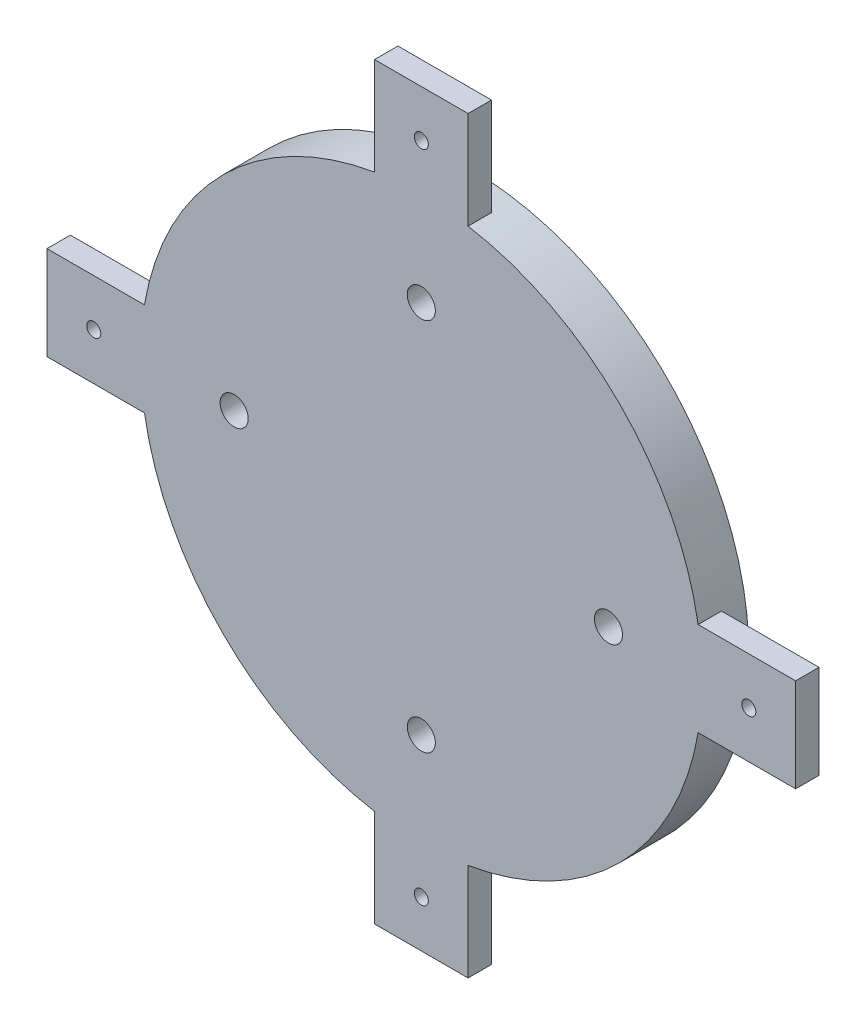
ISO-10303-21;
HEADER;
FILE_DESCRIPTION(('STEP AP214'),'2;1');
FILE_NAME('part.step','',(''),(''),'','','');
FILE_SCHEMA(('AUTOMOTIVE_DESIGN { 1 0 10303 214 1 1 1 1 }'));
ENDSEC;
DATA;
#1=APPLICATION_CONTEXT('core data for automotive mechanical design processes');
#2=APPLICATION_PROTOCOL_DEFINITION('international standard','automotive_design',2000,#1);
#3=PRODUCT_CONTEXT('',#1,'mechanical');
#4=PRODUCT('Part','Part','',(#3));
#5=PRODUCT_RELATED_PRODUCT_CATEGORY('part','',(#4));
#6=PRODUCT_DEFINITION_FORMATION('','',#4);
#7=PRODUCT_DEFINITION_CONTEXT('part definition',#1,'design');
#8=PRODUCT_DEFINITION('design','',#6,#7);
#9=PRODUCT_DEFINITION_SHAPE('','',#8);
#10=(LENGTH_UNIT() NAMED_UNIT(*) SI_UNIT(.MILLI.,.METRE.));
#11=(NAMED_UNIT(*) PLANE_ANGLE_UNIT() SI_UNIT($,.RADIAN.));
#12=(NAMED_UNIT(*) SI_UNIT($,.STERADIAN.) SOLID_ANGLE_UNIT());
#13=UNCERTAINTY_MEASURE_WITH_UNIT(LENGTH_MEASURE(1.E-05),#10,'distance_accuracy_value','');
#14=(GEOMETRIC_REPRESENTATION_CONTEXT(3) GLOBAL_UNCERTAINTY_ASSIGNED_CONTEXT((#13)) GLOBAL_UNIT_ASSIGNED_CONTEXT((#10,
#11,#12)) REPRESENTATION_CONTEXT('',''));
#15=CARTESIAN_POINT('',(0.,0.,0.));
#16=DIRECTION('',(0.,0.,1.));
#17=DIRECTION('',(1.,0.,0.));
#18=AXIS2_PLACEMENT_3D('',#15,#16,#17);
#19=CARTESIAN_POINT('',(0.,0.,5.));
#20=DIRECTION('',(0.,0.,-1.));
#21=DIRECTION('',(-1.,0.,0.));
#22=AXIS2_PLACEMENT_3D('',#19,#20,#21);
#23=CYLINDRICAL_SURFACE('',#22,60.);
#24=CARTESIAN_POINT('',(0.,0.,-10.));
#25=DIRECTION('',(0.,0.,-1.));
#26=DIRECTION('',(-1.,0.,0.));
#27=AXIS2_PLACEMENT_3D('',#24,#25,#26);
#28=CIRCLE('',#27,60.);
#29=CARTESIAN_POINT('',(-60.,0.,-10.));
#30=VERTEX_POINT('',#29);
#31=EDGE_CURVE('E169',#30,#30,#28,.T.);
#32=ORIENTED_EDGE('',*,*,#31,.F.);
#33=EDGE_LOOP('',(#32));
#34=FACE_BOUND('',#33,.T.);
#35=CARTESIAN_POINT('',(0.,0.,0.));
#36=DIRECTION('',(0.,0.,1.));
#37=DIRECTION('',(1.,0.,0.));
#38=AXIS2_PLACEMENT_3D('',#35,#36,#37);
#39=CIRCLE('',#38,60.);
#40=CARTESIAN_POINT('',(59.1607978309962,9.99999999999999,0.));
#41=VERTEX_POINT('',#40);
#42=CARTESIAN_POINT('',(9.99999999999947,59.1607978309962,0.));
#43=VERTEX_POINT('',#42);
#44=EDGE_CURVE('E11',#41,#43,#39,.T.);
#45=ORIENTED_EDGE('',*,*,#44,.F.);
#46=DIRECTION('',(0.,0.,1.));
#47=VECTOR('',#46,1.);
#48=CARTESIAN_POINT('',(59.1607978309962,9.99999999999999,-10.));
#49=LINE('',#48,#47);
#50=CARTESIAN_POINT('',(59.1607978309962,9.99999999999999,-5.));
#51=VERTEX_POINT('',#50);
#52=EDGE_CURVE('E191',#41,#51,#49,.F.);
#53=ORIENTED_EDGE('',*,*,#52,.T.);
#54=CARTESIAN_POINT('',(0.,0.,-5.));
#55=DIRECTION('',(0.,0.,1.));
#56=DIRECTION('',(1.,0.,0.));
#57=AXIS2_PLACEMENT_3D('',#54,#55,#56);
#58=CIRCLE('',#57,60.);
#59=CARTESIAN_POINT('',(59.1607978309962,-10.,-5.));
#60=VERTEX_POINT('',#59);
#61=EDGE_CURVE('E183',#51,#60,#58,.F.);
#62=ORIENTED_EDGE('',*,*,#61,.T.);
#63=DIRECTION('',(0.,0.,1.));
#64=VECTOR('',#63,1.);
#65=CARTESIAN_POINT('',(59.1607978309962,-10.,-10.));
#66=LINE('',#65,#64);
#67=CARTESIAN_POINT('',(59.1607978309962,-10.,0.));
#68=VERTEX_POINT('',#67);
#69=EDGE_CURVE('E187',#60,#68,#66,.T.);
#70=ORIENTED_EDGE('',*,*,#69,.T.);
#71=CARTESIAN_POINT('',(9.99999999999947,-59.1607978309962,0.));
#72=VERTEX_POINT('',#71);
#73=EDGE_CURVE('E50',#72,#68,#39,.T.);
#74=ORIENTED_EDGE('',*,*,#73,.F.);
#75=DIRECTION('',(0.,0.,1.));
#76=VECTOR('',#75,1.);
#77=CARTESIAN_POINT('',(9.99999999999947,-59.1607978309963,-10.));
#78=LINE('',#77,#76);
#79=CARTESIAN_POINT('',(9.99999999999947,-59.1607978309963,-5.));
#80=VERTEX_POINT('',#79);
#81=EDGE_CURVE('E211',#72,#80,#78,.F.);
#82=ORIENTED_EDGE('',*,*,#81,.T.);
#83=CARTESIAN_POINT('',(0.,0.,-5.));
#84=DIRECTION('',(0.,0.,1.));
#85=DIRECTION('',(1.,0.,0.));
#86=AXIS2_PLACEMENT_3D('',#83,#84,#85);
#87=CIRCLE('',#86,60.);
#88=CARTESIAN_POINT('',(-10.0000000000005,-59.1607978309961,-5.));
#89=VERTEX_POINT('',#88);
#90=EDGE_CURVE('E207',#80,#89,#87,.F.);
#91=ORIENTED_EDGE('',*,*,#90,.T.);
#92=DIRECTION('',(0.,0.,1.));
#93=VECTOR('',#92,1.);
#94=CARTESIAN_POINT('',(-10.0000000000005,-59.1607978309961,-10.));
#95=LINE('',#94,#93);
#96=CARTESIAN_POINT('',(-10.0000000000005,-59.1607978309961,0.));
#97=VERTEX_POINT('',#96);
#98=EDGE_CURVE('E215',#89,#97,#95,.T.);
#99=ORIENTED_EDGE('',*,*,#98,.T.);
#100=CARTESIAN_POINT('',(-59.1607978309962,-10.,0.));
#101=VERTEX_POINT('',#100);
#102=EDGE_CURVE('E105',#101,#97,#39,.T.);
#103=ORIENTED_EDGE('',*,*,#102,.F.);
#104=DIRECTION('',(0.,0.,1.));
#105=VECTOR('',#104,1.);
#106=CARTESIAN_POINT('',(-59.1607978309962,-10.,-10.));
#107=LINE('',#106,#105);
#108=CARTESIAN_POINT('',(-59.1607978309962,-10.,-5.));
#109=VERTEX_POINT('',#108);
#110=EDGE_CURVE('E199',#101,#109,#107,.F.);
#111=ORIENTED_EDGE('',*,*,#110,.T.);
#112=CARTESIAN_POINT('',(0.,0.,-5.));
#113=DIRECTION('',(0.,0.,-1.));
#114=DIRECTION('',(-1.,0.,0.));
#115=AXIS2_PLACEMENT_3D('',#112,#113,#114);
#116=CIRCLE('',#115,60.);
#117=CARTESIAN_POINT('',(-59.1607978309962,9.99999999999999,-5.));
#118=VERTEX_POINT('',#117);
#119=EDGE_CURVE('E195',#118,#109,#116,.F.);
#120=ORIENTED_EDGE('',*,*,#119,.F.);
#121=DIRECTION('',(0.,0.,1.));
#122=VECTOR('',#121,1.);
#123=CARTESIAN_POINT('',(-59.1607978309962,9.99999999999999,-10.));
#124=LINE('',#123,#122);
#125=CARTESIAN_POINT('',(-59.1607978309962,9.99999999999999,0.));
#126=VERTEX_POINT('',#125);
#127=EDGE_CURVE('E203',#118,#126,#124,.T.);
#128=ORIENTED_EDGE('',*,*,#127,.T.);
#129=CARTESIAN_POINT('',(-10.0000000000005,59.1607978309961,0.));
#130=VERTEX_POINT('',#129);
#131=EDGE_CURVE('E48',#130,#126,#39,.T.);
#132=ORIENTED_EDGE('',*,*,#131,.F.);
#133=DIRECTION('',(0.,0.,1.));
#134=VECTOR('',#133,1.);
#135=CARTESIAN_POINT('',(-10.0000000000005,59.1607978309961,-10.));
#136=LINE('',#135,#134);
#137=CARTESIAN_POINT('',(-10.0000000000005,59.1607978309961,-5.));
#138=VERTEX_POINT('',#137);
#139=EDGE_CURVE('E57',#130,#138,#136,.F.);
#140=ORIENTED_EDGE('',*,*,#139,.T.);
#141=CARTESIAN_POINT('',(0.,0.,-5.));
#142=DIRECTION('',(0.,0.,-1.));
#143=DIRECTION('',(-1.,0.,0.));
#144=AXIS2_PLACEMENT_3D('',#141,#142,#143);
#145=CIRCLE('',#144,60.);
#146=CARTESIAN_POINT('',(9.99999999999947,59.1607978309963,-5.));
#147=VERTEX_POINT('',#146);
#148=EDGE_CURVE('E173',#147,#138,#145,.F.);
#149=ORIENTED_EDGE('',*,*,#148,.F.);
#150=DIRECTION('',(0.,0.,1.));
#151=VECTOR('',#150,1.);
#152=CARTESIAN_POINT('',(9.99999999999947,59.1607978309963,-10.));
#153=LINE('',#152,#151);
#154=EDGE_CURVE('E177',#147,#43,#153,.T.);
#155=ORIENTED_EDGE('',*,*,#154,.T.);
#156=EDGE_LOOP('',(#45,#53,#62,#70,#74,#82,#91,#99,#103,#111,#120,#128,#132,#140,#149,#155));
#157=FACE_BOUND('',#156,.T.);
#158=ADVANCED_FACE('F39',(#34,#157),#23,.T.);
#159=CARTESIAN_POINT('',(-10.0000000000005,-49.9999999999999,-5.));
#160=DIRECTION('',(1.,0.,0.));
#161=DIRECTION('',(0.,0.,-1.));
#162=AXIS2_PLACEMENT_3D('',#159,#160,#161);
#163=PLANE('',#162);
#164=ORIENTED_EDGE('',*,*,#98,.F.);
#165=DIRECTION('',(0.,1.,0.));
#166=VECTOR('',#165,1.);
#167=CARTESIAN_POINT('',(-10.0000000000005,-49.9999999999999,-5.));
#168=LINE('',#167,#166);
#169=CARTESIAN_POINT('',(-10.0000000000005,-80.0000000000001,-5.));
#170=VERTEX_POINT('',#169);
#171=EDGE_CURVE('E90',#170,#89,#168,.T.);
#172=ORIENTED_EDGE('',*,*,#171,.F.);
#173=DIRECTION('',(0.,0.,1.));
#174=VECTOR('',#173,1.);
#175=CARTESIAN_POINT('',(-10.0000000000005,-80.0000000000001,-5.));
#176=LINE('',#175,#174);
#177=CARTESIAN_POINT('',(-10.0000000000005,-80.0000000000001,0.));
#178=VERTEX_POINT('',#177);
#179=EDGE_CURVE('E82',#170,#178,#176,.T.);
#180=ORIENTED_EDGE('',*,*,#179,.T.);
#181=DIRECTION('',(0.,1.,0.));
#182=VECTOR('',#181,1.);
#183=CARTESIAN_POINT('',(-10.0000000000005,-49.9999999999999,0.));
#184=LINE('',#183,#182);
#185=EDGE_CURVE('E98',#178,#97,#184,.T.);
#186=ORIENTED_EDGE('',*,*,#185,.T.);
#187=EDGE_LOOP('',(#164,#172,#180,#186));
#188=FACE_BOUND('',#187,.T.);
#189=ADVANCED_FACE('F96',(#188),#163,.F.);
#190=CARTESIAN_POINT('',(9.99999999999947,-50.0000000000001,-5.));
#191=DIRECTION('',(-1.,0.,0.));
#192=DIRECTION('',(0.,0.,1.));
#193=AXIS2_PLACEMENT_3D('',#190,#191,#192);
#194=PLANE('',#193);
#195=ORIENTED_EDGE('',*,*,#81,.F.);
#196=DIRECTION('',(0.,-1.,0.));
#197=VECTOR('',#196,1.);
#198=CARTESIAN_POINT('',(9.99999999999947,-50.0000000000001,0.));
#199=LINE('',#198,#197);
#200=CARTESIAN_POINT('',(9.99999999999947,-80.0000000000001,0.));
#201=VERTEX_POINT('',#200);
#202=EDGE_CURVE('E91',#72,#201,#199,.T.);
#203=ORIENTED_EDGE('',*,*,#202,.T.);
#204=DIRECTION('',(0.,0.,1.));
#205=VECTOR('',#204,1.);
#206=CARTESIAN_POINT('',(9.99999999999947,-80.0000000000001,-5.));
#207=LINE('',#206,#205);
#208=CARTESIAN_POINT('',(9.99999999999947,-80.0000000000001,-5.));
#209=VERTEX_POINT('',#208);
#210=EDGE_CURVE('E85',#209,#201,#207,.T.);
#211=ORIENTED_EDGE('',*,*,#210,.F.);
#212=DIRECTION('',(0.,-1.,0.));
#213=VECTOR('',#212,1.);
#214=CARTESIAN_POINT('',(9.99999999999947,-50.0000000000001,-5.));
#215=LINE('',#214,#213);
#216=EDGE_CURVE('E310',#80,#209,#215,.T.);
#217=ORIENTED_EDGE('',*,*,#216,.F.);
#218=EDGE_LOOP('',(#195,#203,#211,#217));
#219=FACE_BOUND('',#218,.T.);
#220=ADVANCED_FACE('F411',(#219),#194,.F.);
#221=CARTESIAN_POINT('',(-50.,9.99999999999999,-5.));
#222=DIRECTION('',(0.,-1.,0.));
#223=DIRECTION('',(0.,0.,-1.));
#224=AXIS2_PLACEMENT_3D('',#221,#222,#223);
#225=PLANE('',#224);
#226=ORIENTED_EDGE('',*,*,#127,.F.);
#227=DIRECTION('',(1.,0.,0.));
#228=VECTOR('',#227,1.);
#229=CARTESIAN_POINT('',(-50.,9.99999999999999,-5.));
#230=LINE('',#229,#228);
#231=CARTESIAN_POINT('',(-80.,9.99999999999999,-5.));
#232=VERTEX_POINT('',#231);
#233=EDGE_CURVE('E287',#232,#118,#230,.T.);
#234=ORIENTED_EDGE('',*,*,#233,.F.);
#235=DIRECTION('',(0.,0.,1.));
#236=VECTOR('',#235,1.);
#237=CARTESIAN_POINT('',(-80.,9.99999999999999,-5.));
#238=LINE('',#237,#236);
#239=CARTESIAN_POINT('',(-80.,9.99999999999999,0.));
#240=VERTEX_POINT('',#239);
#241=EDGE_CURVE('E108',#232,#240,#238,.T.);
#242=ORIENTED_EDGE('',*,*,#241,.T.);
#243=DIRECTION('',(1.,0.,0.));
#244=VECTOR('',#243,1.);
#245=CARTESIAN_POINT('',(-50.,9.99999999999999,0.));
#246=LINE('',#245,#244);
#247=EDGE_CURVE('E299',#240,#126,#246,.T.);
#248=ORIENTED_EDGE('',*,*,#247,.T.);
#249=EDGE_LOOP('',(#226,#234,#242,#248));
#250=FACE_BOUND('',#249,.T.);
#251=ADVANCED_FACE('F333',(#250),#225,.F.);
#252=CARTESIAN_POINT('',(-50.,-10.,-5.));
#253=DIRECTION('',(0.,1.,0.));
#254=DIRECTION('',(0.,0.,1.));
#255=AXIS2_PLACEMENT_3D('',#252,#253,#254);
#256=PLANE('',#255);
#257=ORIENTED_EDGE('',*,*,#110,.F.);
#258=DIRECTION('',(-1.,0.,0.));
#259=VECTOR('',#258,1.);
#260=CARTESIAN_POINT('',(-50.,-10.,0.));
#261=LINE('',#260,#259);
#262=CARTESIAN_POINT('',(-80.,-10.,0.));
#263=VERTEX_POINT('',#262);
#264=EDGE_CURVE('E288',#101,#263,#261,.T.);
#265=ORIENTED_EDGE('',*,*,#264,.T.);
#266=DIRECTION('',(0.,0.,1.));
#267=VECTOR('',#266,1.);
#268=CARTESIAN_POINT('',(-80.,-10.,-5.));
#269=LINE('',#268,#267);
#270=CARTESIAN_POINT('',(-80.,-10.,-5.));
#271=VERTEX_POINT('',#270);
#272=EDGE_CURVE('E114',#271,#263,#269,.T.);
#273=ORIENTED_EDGE('',*,*,#272,.F.);
#274=DIRECTION('',(-1.,0.,0.));
#275=VECTOR('',#274,1.);
#276=CARTESIAN_POINT('',(-50.,-10.,-5.));
#277=LINE('',#276,#275);
#278=EDGE_CURVE('E292',#109,#271,#277,.T.);
#279=ORIENTED_EDGE('',*,*,#278,.F.);
#280=EDGE_LOOP('',(#257,#265,#273,#279));
#281=FACE_BOUND('',#280,.T.);
#282=ADVANCED_FACE('F418',(#281),#256,.F.);
#283=CARTESIAN_POINT('',(50.,9.99999999999999,-5.));
#284=DIRECTION('',(0.,-1.,0.));
#285=DIRECTION('',(0.,0.,-1.));
#286=AXIS2_PLACEMENT_3D('',#283,#284,#285);
#287=PLANE('',#286);
#288=ORIENTED_EDGE('',*,*,#52,.F.);
#289=DIRECTION('',(1.,0.,0.));
#290=VECTOR('',#289,1.);
#291=CARTESIAN_POINT('',(50.,9.99999999999999,0.));
#292=LINE('',#291,#290);
#293=CARTESIAN_POINT('',(80.,9.99999999999999,0.));
#294=VERTEX_POINT('',#293);
#295=EDGE_CURVE('E250',#41,#294,#292,.T.);
#296=ORIENTED_EDGE('',*,*,#295,.T.);
#297=DIRECTION('',(0.,0.,1.));
#298=VECTOR('',#297,1.);
#299=CARTESIAN_POINT('',(80.,9.99999999999999,-5.));
#300=LINE('',#299,#298);
#301=CARTESIAN_POINT('',(80.,9.99999999999999,-5.));
#302=VERTEX_POINT('',#301);
#303=EDGE_CURVE('E278',#302,#294,#300,.T.);
#304=ORIENTED_EDGE('',*,*,#303,.F.);
#305=DIRECTION('',(1.,0.,0.));
#306=VECTOR('',#305,1.);
#307=CARTESIAN_POINT('',(50.,9.99999999999999,-5.));
#308=LINE('',#307,#306);
#309=EDGE_CURVE('E251',#51,#302,#308,.T.);
#310=ORIENTED_EDGE('',*,*,#309,.F.);
#311=EDGE_LOOP('',(#288,#296,#304,#310));
#312=FACE_BOUND('',#311,.T.);
#313=ADVANCED_FACE('F395',(#312),#287,.F.);
#314=CARTESIAN_POINT('',(50.,-10.,-5.));
#315=DIRECTION('',(0.,1.,0.));
#316=DIRECTION('',(0.,0.,1.));
#317=AXIS2_PLACEMENT_3D('',#314,#315,#316);
#318=PLANE('',#317);
#319=ORIENTED_EDGE('',*,*,#69,.F.);
#320=DIRECTION('',(-1.,0.,0.));
#321=VECTOR('',#320,1.);
#322=CARTESIAN_POINT('',(50.,-10.,-5.));
#323=LINE('',#322,#321);
#324=CARTESIAN_POINT('',(80.,-10.,-5.));
#325=VERTEX_POINT('',#324);
#326=EDGE_CURVE('E260',#325,#60,#323,.T.);
#327=ORIENTED_EDGE('',*,*,#326,.F.);
#328=DIRECTION('',(0.,0.,1.));
#329=VECTOR('',#328,1.);
#330=CARTESIAN_POINT('',(80.,-10.,-5.));
#331=LINE('',#330,#329);
#332=CARTESIAN_POINT('',(80.,-10.,0.));
#333=VERTEX_POINT('',#332);
#334=EDGE_CURVE('E264',#325,#333,#331,.T.);
#335=ORIENTED_EDGE('',*,*,#334,.T.);
#336=DIRECTION('',(-1.,0.,0.));
#337=VECTOR('',#336,1.);
#338=CARTESIAN_POINT('',(50.,-10.,0.));
#339=LINE('',#338,#337);
#340=EDGE_CURVE('E256',#333,#68,#339,.T.);
#341=ORIENTED_EDGE('',*,*,#340,.T.);
#342=EDGE_LOOP('',(#319,#327,#335,#341));
#343=FACE_BOUND('',#342,.T.);
#344=ADVANCED_FACE('F406',(#343),#318,.F.);
#345=CARTESIAN_POINT('',(-10.0000000000005,49.9999999999999,-5.));
#346=DIRECTION('',(1.,0.,0.));
#347=DIRECTION('',(0.,0.,-1.));
#348=AXIS2_PLACEMENT_3D('',#345,#346,#347);
#349=PLANE('',#348);
#350=ORIENTED_EDGE('',*,*,#139,.F.);
#351=DIRECTION('',(0.,1.,0.));
#352=VECTOR('',#351,1.);
#353=CARTESIAN_POINT('',(-10.0000000000005,49.9999999999999,0.));
#354=LINE('',#353,#352);
#355=CARTESIAN_POINT('',(-10.0000000000005,80.0000000000001,0.));
#356=VERTEX_POINT('',#355);
#357=EDGE_CURVE('E218',#130,#356,#354,.T.);
#358=ORIENTED_EDGE('',*,*,#357,.T.);
#359=DIRECTION('',(0.,0.,1.));
#360=VECTOR('',#359,1.);
#361=CARTESIAN_POINT('',(-10.0000000000005,80.0000000000001,-5.));
#362=LINE('',#361,#360);
#363=CARTESIAN_POINT('',(-10.0000000000005,80.0000000000001,-5.));
#364=VERTEX_POINT('',#363);
#365=EDGE_CURVE('E246',#364,#356,#362,.T.);
#366=ORIENTED_EDGE('',*,*,#365,.F.);
#367=DIRECTION('',(0.,1.,0.));
#368=VECTOR('',#367,1.);
#369=CARTESIAN_POINT('',(-10.0000000000005,49.9999999999999,-5.));
#370=LINE('',#369,#368);
#371=EDGE_CURVE('E219',#138,#364,#370,.T.);
#372=ORIENTED_EDGE('',*,*,#371,.F.);
#373=EDGE_LOOP('',(#350,#358,#366,#372));
#374=FACE_BOUND('',#373,.T.);
#375=ADVANCED_FACE('F450',(#374),#349,.F.);
#376=CARTESIAN_POINT('',(9.99999999999947,50.0000000000001,-5.));
#377=DIRECTION('',(-1.,0.,0.));
#378=DIRECTION('',(0.,0.,1.));
#379=AXIS2_PLACEMENT_3D('',#376,#377,#378);
#380=PLANE('',#379);
#381=ORIENTED_EDGE('',*,*,#154,.F.);
#382=DIRECTION('',(0.,-1.,0.));
#383=VECTOR('',#382,1.);
#384=CARTESIAN_POINT('',(9.99999999999947,50.0000000000001,-5.));
#385=LINE('',#384,#383);
#386=CARTESIAN_POINT('',(9.99999999999947,80.0000000000001,-5.));
#387=VERTEX_POINT('',#386);
#388=EDGE_CURVE('E228',#387,#147,#385,.T.);
#389=ORIENTED_EDGE('',*,*,#388,.F.);
#390=DIRECTION('',(0.,0.,1.));
#391=VECTOR('',#390,1.);
#392=CARTESIAN_POINT('',(9.99999999999947,80.0000000000001,-5.));
#393=LINE('',#392,#391);
#394=CARTESIAN_POINT('',(9.99999999999947,80.0000000000001,0.));
#395=VERTEX_POINT('',#394);
#396=EDGE_CURVE('E232',#387,#395,#393,.T.);
#397=ORIENTED_EDGE('',*,*,#396,.T.);
#398=DIRECTION('',(0.,-1.,0.));
#399=VECTOR('',#398,1.);
#400=CARTESIAN_POINT('',(9.99999999999947,50.0000000000001,0.));
#401=LINE('',#400,#399);
#402=EDGE_CURVE('E224',#395,#43,#401,.T.);
#403=ORIENTED_EDGE('',*,*,#402,.T.);
#404=EDGE_LOOP('',(#381,#389,#397,#403));
#405=FACE_BOUND('',#404,.T.);
#406=ADVANCED_FACE('F447',(#405),#380,.F.);
#407=CARTESIAN_POINT('',(0.,0.,0.));
#408=DIRECTION('',(0.,0.,1.));
#409=DIRECTION('',(1.,0.,0.));
#410=AXIS2_PLACEMENT_3D('',#407,#408,#409);
#411=PLANE('',#410);
#412=CARTESIAN_POINT('',(-70.,0.,0.));
#413=DIRECTION('',(0.,0.,1.));
#414=DIRECTION('',(1.,0.,0.));
#415=AXIS2_PLACEMENT_3D('',#412,#413,#414);
#416=CIRCLE('',#415,1.5);
#417=CARTESIAN_POINT('',(-68.5,0.,0.));
#418=VERTEX_POINT('',#417);
#419=EDGE_CURVE('E128',#418,#418,#416,.T.);
#420=ORIENTED_EDGE('',*,*,#419,.F.);
#421=EDGE_LOOP('',(#420));
#422=FACE_BOUND('',#421,.T.);
#423=CARTESIAN_POINT('',(0.,70.,0.));
#424=DIRECTION('',(0.,0.,1.));
#425=DIRECTION('',(-1.,0.,0.));
#426=AXIS2_PLACEMENT_3D('',#423,#424,#425);
#427=CIRCLE('',#426,1.50000000000049);
#428=CARTESIAN_POINT('',(-1.50000000000053,70.,0.));
#429=VERTEX_POINT('',#428);
#430=EDGE_CURVE('E704',#429,#429,#427,.T.);
#431=ORIENTED_EDGE('',*,*,#430,.F.);
#432=EDGE_LOOP('',(#431));
#433=FACE_BOUND('',#432,.T.);
#434=CARTESIAN_POINT('',(0.,-70.,0.));
#435=DIRECTION('',(0.,0.,1.));
#436=DIRECTION('',(1.,0.,0.));
#437=AXIS2_PLACEMENT_3D('',#434,#435,#436);
#438=CIRCLE('',#437,1.4999999999995);
#439=CARTESIAN_POINT('',(1.49999999999952,-70.,0.));
#440=VERTEX_POINT('',#439);
#441=EDGE_CURVE('E700',#440,#440,#438,.T.);
#442=ORIENTED_EDGE('',*,*,#441,.F.);
#443=EDGE_LOOP('',(#442));
#444=FACE_BOUND('',#443,.T.);
#445=CARTESIAN_POINT('',(70.,0.,0.));
#446=DIRECTION('',(0.,0.,1.));
#447=DIRECTION('',(-1.,0.,0.));
#448=AXIS2_PLACEMENT_3D('',#445,#446,#447);
#449=CIRCLE('',#448,1.5);
#450=CARTESIAN_POINT('',(68.5,0.,0.));
#451=VERTEX_POINT('',#450);
#452=EDGE_CURVE('E692',#451,#451,#449,.T.);
#453=ORIENTED_EDGE('',*,*,#452,.F.);
#454=EDGE_LOOP('',(#453));
#455=FACE_BOUND('',#454,.T.);
#456=CARTESIAN_POINT('',(0.,-40.,0.));
#457=DIRECTION('',(0.,0.,1.));
#458=DIRECTION('',(1.,0.,0.));
#459=AXIS2_PLACEMENT_3D('',#456,#457,#458);
#460=CIRCLE('',#459,3.);
#461=CARTESIAN_POINT('',(3.,-40.,0.));
#462=VERTEX_POINT('',#461);
#463=EDGE_CURVE('E680',#462,#462,#460,.T.);
#464=ORIENTED_EDGE('',*,*,#463,.F.);
#465=EDGE_LOOP('',(#464));
#466=FACE_BOUND('',#465,.T.);
#467=CARTESIAN_POINT('',(0.,40.,0.));
#468=DIRECTION('',(0.,0.,1.));
#469=DIRECTION('',(-1.,0.,0.));
#470=AXIS2_PLACEMENT_3D('',#467,#468,#469);
#471=CIRCLE('',#470,3.);
#472=CARTESIAN_POINT('',(-3.,40.,0.));
#473=VERTEX_POINT('',#472);
#474=EDGE_CURVE('E670',#473,#473,#471,.T.);
#475=ORIENTED_EDGE('',*,*,#474,.F.);
#476=EDGE_LOOP('',(#475));
#477=FACE_BOUND('',#476,.T.);
#478=CARTESIAN_POINT('',(-40.,-1.45716771982052E-13,0.));
#479=DIRECTION('',(0.,0.,1.));
#480=DIRECTION('',(-1.,0.,0.));
#481=AXIS2_PLACEMENT_3D('',#478,#479,#480);
#482=CIRCLE('',#481,2.99999999999998);
#483=CARTESIAN_POINT('',(-43.,-1.45716771982052E-13,0.));
#484=VERTEX_POINT('',#483);
#485=EDGE_CURVE('E165',#484,#484,#482,.T.);
#486=ORIENTED_EDGE('',*,*,#485,.F.);
#487=EDGE_LOOP('',(#486));
#488=FACE_BOUND('',#487,.T.);
#489=CARTESIAN_POINT('',(40.,1.45716771982052E-13,0.));
#490=DIRECTION('',(0.,0.,1.));
#491=DIRECTION('',(1.,0.,0.));
#492=AXIS2_PLACEMENT_3D('',#489,#490,#491);
#493=CIRCLE('',#492,3.);
#494=CARTESIAN_POINT('',(43.,1.45716771982052E-13,0.));
#495=VERTEX_POINT('',#494);
#496=EDGE_CURVE('E154',#495,#495,#493,.T.);
#497=ORIENTED_EDGE('',*,*,#496,.F.);
#498=EDGE_LOOP('',(#497));
#499=FACE_BOUND('',#498,.T.);
#500=DIRECTION('',(-1.,0.,0.));
#501=VECTOR('',#500,1.);
#502=CARTESIAN_POINT('',(-10.0000000000005,-80.0000000000001,0.));
#503=LINE('',#502,#501);
#504=EDGE_CURVE('E79',#201,#178,#503,.T.);
#505=ORIENTED_EDGE('',*,*,#504,.F.);
#506=ORIENTED_EDGE('',*,*,#202,.F.);
#507=ORIENTED_EDGE('',*,*,#73,.T.);
#508=ORIENTED_EDGE('',*,*,#340,.F.);
#509=DIRECTION('',(0.,-1.,0.));
#510=VECTOR('',#509,1.);
#511=CARTESIAN_POINT('',(80.,9.99999999999999,0.));
#512=LINE('',#511,#510);
#513=EDGE_CURVE('E268',#294,#333,#512,.T.);
#514=ORIENTED_EDGE('',*,*,#513,.F.);
#515=ORIENTED_EDGE('',*,*,#295,.F.);
#516=ORIENTED_EDGE('',*,*,#44,.T.);
#517=ORIENTED_EDGE('',*,*,#402,.F.);
#518=DIRECTION('',(1.,0.,0.));
#519=VECTOR('',#518,1.);
#520=CARTESIAN_POINT('',(-10.0000000000005,80.0000000000001,0.));
#521=LINE('',#520,#519);
#522=EDGE_CURVE('E236',#356,#395,#521,.T.);
#523=ORIENTED_EDGE('',*,*,#522,.F.);
#524=ORIENTED_EDGE('',*,*,#357,.F.);
#525=ORIENTED_EDGE('',*,*,#131,.T.);
#526=ORIENTED_EDGE('',*,*,#247,.F.);
#527=DIRECTION('',(0.,1.,0.));
#528=VECTOR('',#527,1.);
#529=CARTESIAN_POINT('',(-80.,9.99999999999999,0.));
#530=LINE('',#529,#528);
#531=EDGE_CURVE('E282',#263,#240,#530,.T.);
#532=ORIENTED_EDGE('',*,*,#531,.F.);
#533=ORIENTED_EDGE('',*,*,#264,.F.);
#534=ORIENTED_EDGE('',*,*,#102,.T.);
#535=ORIENTED_EDGE('',*,*,#185,.F.);
#536=EDGE_LOOP('',(#505,#506,#507,#508,#514,#515,#516,#517,#523,#524,#525,#526,#532,#533,#534,#535));
#537=FACE_BOUND('',#536,.T.);
#538=ADVANCED_FACE('F102',(#422,#433,#444,#455,#466,#477,#488,#499,#537),#411,.T.);
#539=CARTESIAN_POINT('',(-10.0000000000005,-80.0000000000001,-5.));
#540=DIRECTION('',(0.,1.,0.));
#541=DIRECTION('',(0.,0.,1.));
#542=AXIS2_PLACEMENT_3D('',#539,#540,#541);
#543=PLANE('',#542);
#544=ORIENTED_EDGE('',*,*,#504,.T.);
#545=ORIENTED_EDGE('',*,*,#179,.F.);
#546=DIRECTION('',(-1.,0.,0.));
#547=VECTOR('',#546,1.);
#548=CARTESIAN_POINT('',(-10.0000000000005,-80.0000000000001,-5.));
#549=LINE('',#548,#547);
#550=EDGE_CURVE('E66',#209,#170,#549,.T.);
#551=ORIENTED_EDGE('',*,*,#550,.F.);
#552=ORIENTED_EDGE('',*,*,#210,.T.);
#553=EDGE_LOOP('',(#544,#545,#551,#552));
#554=FACE_BOUND('',#553,.T.);
#555=ADVANCED_FACE('F81',(#554),#543,.F.);
#556=CARTESIAN_POINT('',(0.,0.,-5.));
#557=DIRECTION('',(0.,0.,1.));
#558=DIRECTION('',(1.,0.,0.));
#559=AXIS2_PLACEMENT_3D('',#556,#557,#558);
#560=PLANE('',#559);
#561=CARTESIAN_POINT('',(0.,-70.,-5.));
#562=DIRECTION('',(0.,0.,1.));
#563=DIRECTION('',(1.,0.,0.));
#564=AXIS2_PLACEMENT_3D('',#561,#562,#563);
#565=CIRCLE('',#564,1.4999999999995);
#566=CARTESIAN_POINT('',(1.49999999999952,-70.,-5.));
#567=VERTEX_POINT('',#566);
#568=EDGE_CURVE('E42',#567,#567,#565,.T.);
#569=ORIENTED_EDGE('',*,*,#568,.T.);
#570=EDGE_LOOP('',(#569));
#571=FACE_BOUND('',#570,.T.);
#572=ORIENTED_EDGE('',*,*,#90,.F.);
#573=ORIENTED_EDGE('',*,*,#216,.T.);
#574=ORIENTED_EDGE('',*,*,#550,.T.);
#575=ORIENTED_EDGE('',*,*,#171,.T.);
#576=EDGE_LOOP('',(#572,#573,#574,#575));
#577=FACE_BOUND('',#576,.T.);
#578=ADVANCED_FACE('F475',(#571,#577),#560,.F.);
#579=CARTESIAN_POINT('',(-80.,9.99999999999999,-5.));
#580=DIRECTION('',(1.,0.,0.));
#581=DIRECTION('',(0.,0.,-1.));
#582=AXIS2_PLACEMENT_3D('',#579,#580,#581);
#583=PLANE('',#582);
#584=ORIENTED_EDGE('',*,*,#531,.T.);
#585=ORIENTED_EDGE('',*,*,#241,.F.);
#586=DIRECTION('',(0.,1.,0.));
#587=VECTOR('',#586,1.);
#588=CARTESIAN_POINT('',(-80.,9.99999999999999,-5.));
#589=LINE('',#588,#587);
#590=EDGE_CURVE('E283',#271,#232,#589,.T.);
#591=ORIENTED_EDGE('',*,*,#590,.F.);
#592=ORIENTED_EDGE('',*,*,#272,.T.);
#593=EDGE_LOOP('',(#584,#585,#591,#592));
#594=FACE_BOUND('',#593,.T.);
#595=ADVANCED_FACE('F347',(#594),#583,.F.);
#596=CARTESIAN_POINT('',(0.,0.,-5.));
#597=DIRECTION('',(0.,0.,-1.));
#598=DIRECTION('',(-1.,0.,0.));
#599=AXIS2_PLACEMENT_3D('',#596,#597,#598);
#600=PLANE('',#599);
#601=CARTESIAN_POINT('',(-70.,0.,-5.));
#602=DIRECTION('',(0.,0.,-1.));
#603=DIRECTION('',(-1.,0.,0.));
#604=AXIS2_PLACEMENT_3D('',#601,#602,#603);
#605=CIRCLE('',#604,1.5);
#606=CARTESIAN_POINT('',(-71.5,0.,-5.));
#607=VERTEX_POINT('',#606);
#608=EDGE_CURVE('E147',#607,#607,#605,.T.);
#609=ORIENTED_EDGE('',*,*,#608,.F.);
#610=EDGE_LOOP('',(#609));
#611=FACE_BOUND('',#610,.T.);
#612=ORIENTED_EDGE('',*,*,#233,.T.);
#613=ORIENTED_EDGE('',*,*,#119,.T.);
#614=ORIENTED_EDGE('',*,*,#278,.T.);
#615=ORIENTED_EDGE('',*,*,#590,.T.);
#616=EDGE_LOOP('',(#612,#613,#614,#615));
#617=FACE_BOUND('',#616,.T.);
#618=ADVANCED_FACE('F339',(#611,#617),#600,.T.);
#619=CARTESIAN_POINT('',(80.,9.99999999999999,-5.));
#620=DIRECTION('',(-1.,0.,0.));
#621=DIRECTION('',(0.,0.,1.));
#622=AXIS2_PLACEMENT_3D('',#619,#620,#621);
#623=PLANE('',#622);
#624=ORIENTED_EDGE('',*,*,#513,.T.);
#625=ORIENTED_EDGE('',*,*,#334,.F.);
#626=DIRECTION('',(0.,-1.,0.));
#627=VECTOR('',#626,1.);
#628=CARTESIAN_POINT('',(80.,9.99999999999999,-5.));
#629=LINE('',#628,#627);
#630=EDGE_CURVE('E255',#302,#325,#629,.T.);
#631=ORIENTED_EDGE('',*,*,#630,.F.);
#632=ORIENTED_EDGE('',*,*,#303,.T.);
#633=EDGE_LOOP('',(#624,#625,#631,#632));
#634=FACE_BOUND('',#633,.T.);
#635=ADVANCED_FACE('F401',(#634),#623,.F.);
#636=CARTESIAN_POINT('',(0.,0.,-5.));
#637=DIRECTION('',(0.,0.,1.));
#638=DIRECTION('',(1.,0.,0.));
#639=AXIS2_PLACEMENT_3D('',#636,#637,#638);
#640=PLANE('',#639);
#641=CARTESIAN_POINT('',(70.,0.,-5.));
#642=DIRECTION('',(0.,0.,1.));
#643=DIRECTION('',(1.,0.,0.));
#644=AXIS2_PLACEMENT_3D('',#641,#642,#643);
#645=CIRCLE('',#644,1.5);
#646=CARTESIAN_POINT('',(71.5,0.,-5.));
#647=VERTEX_POINT('',#646);
#648=EDGE_CURVE('E144',#647,#647,#645,.T.);
#649=ORIENTED_EDGE('',*,*,#648,.T.);
#650=EDGE_LOOP('',(#649));
#651=FACE_BOUND('',#650,.T.);
#652=ORIENTED_EDGE('',*,*,#61,.F.);
#653=ORIENTED_EDGE('',*,*,#309,.T.);
#654=ORIENTED_EDGE('',*,*,#630,.T.);
#655=ORIENTED_EDGE('',*,*,#326,.T.);
#656=EDGE_LOOP('',(#652,#653,#654,#655));
#657=FACE_BOUND('',#656,.T.);
#658=ADVANCED_FACE('F408',(#651,#657),#640,.F.);
#659=CARTESIAN_POINT('',(-10.0000000000005,80.0000000000001,-5.));
#660=DIRECTION('',(0.,-1.,0.));
#661=DIRECTION('',(0.,0.,-1.));
#662=AXIS2_PLACEMENT_3D('',#659,#660,#661);
#663=PLANE('',#662);
#664=ORIENTED_EDGE('',*,*,#522,.T.);
#665=ORIENTED_EDGE('',*,*,#396,.F.);
#666=DIRECTION('',(1.,0.,0.));
#667=VECTOR('',#666,1.);
#668=CARTESIAN_POINT('',(-10.0000000000005,80.0000000000001,-5.));
#669=LINE('',#668,#667);
#670=EDGE_CURVE('E223',#364,#387,#669,.T.);
#671=ORIENTED_EDGE('',*,*,#670,.F.);
#672=ORIENTED_EDGE('',*,*,#365,.T.);
#673=EDGE_LOOP('',(#664,#665,#671,#672));
#674=FACE_BOUND('',#673,.T.);
#675=ADVANCED_FACE('F440',(#674),#663,.F.);
#676=CARTESIAN_POINT('',(0.,0.,-5.));
#677=DIRECTION('',(0.,0.,-1.));
#678=DIRECTION('',(-1.,0.,0.));
#679=AXIS2_PLACEMENT_3D('',#676,#677,#678);
#680=PLANE('',#679);
#681=CARTESIAN_POINT('',(0.,70.,-5.));
#682=DIRECTION('',(0.,0.,-1.));
#683=DIRECTION('',(-1.,0.,0.));
#684=AXIS2_PLACEMENT_3D('',#681,#682,#683);
#685=CIRCLE('',#684,1.50000000000049);
#686=CARTESIAN_POINT('',(-1.50000000000053,70.,-5.));
#687=VERTEX_POINT('',#686);
#688=EDGE_CURVE('E140',#687,#687,#685,.T.);
#689=ORIENTED_EDGE('',*,*,#688,.F.);
#690=EDGE_LOOP('',(#689));
#691=FACE_BOUND('',#690,.T.);
#692=ORIENTED_EDGE('',*,*,#388,.T.);
#693=ORIENTED_EDGE('',*,*,#148,.T.);
#694=ORIENTED_EDGE('',*,*,#371,.T.);
#695=ORIENTED_EDGE('',*,*,#670,.T.);
#696=EDGE_LOOP('',(#692,#693,#694,#695));
#697=FACE_BOUND('',#696,.T.);
#698=ADVANCED_FACE('F430',(#691,#697),#680,.T.);
#699=CARTESIAN_POINT('',(0.,0.,-10.));
#700=DIRECTION('',(0.,0.,-1.));
#701=DIRECTION('',(-1.,0.,0.));
#702=AXIS2_PLACEMENT_3D('',#699,#700,#701);
#703=PLANE('',#702);
#704=CARTESIAN_POINT('',(-8.2572837456496E-13,40.,-10.));
#705=DIRECTION('',(0.,0.,1.));
#706=DIRECTION('',(-1.,0.,0.));
#707=AXIS2_PLACEMENT_3D('',#704,#705,#706);
#708=CIRCLE('',#707,1.50000000000001);
#709=CARTESIAN_POINT('',(-1.50000000000083,40.,-10.));
#710=VERTEX_POINT('',#709);
#711=EDGE_CURVE('E708',#710,#710,#708,.T.);
#712=ORIENTED_EDGE('',*,*,#711,.T.);
#713=EDGE_LOOP('',(#712));
#714=FACE_BOUND('',#713,.T.);
#715=CARTESIAN_POINT('',(-40.,-1.45716771982052E-13,-10.));
#716=DIRECTION('',(0.,0.,1.));
#717=DIRECTION('',(1.,0.,0.));
#718=AXIS2_PLACEMENT_3D('',#715,#716,#717);
#719=CIRCLE('',#718,1.5);
#720=CARTESIAN_POINT('',(-38.5,-1.45716771982052E-13,-10.));
#721=VERTEX_POINT('',#720);
#722=EDGE_CURVE('E691',#721,#721,#719,.T.);
#723=ORIENTED_EDGE('',*,*,#722,.T.);
#724=EDGE_LOOP('',(#723));
#725=FACE_BOUND('',#724,.T.);
#726=CARTESIAN_POINT('',(40.,-1.45716771982052E-13,-10.));
#727=DIRECTION('',(0.,0.,1.));
#728=DIRECTION('',(-1.,0.,0.));
#729=AXIS2_PLACEMENT_3D('',#726,#727,#728);
#730=CIRCLE('',#729,1.5);
#731=CARTESIAN_POINT('',(38.5,-1.45716771982052E-13,-10.));
#732=VERTEX_POINT('',#731);
#733=EDGE_CURVE('E687',#732,#732,#730,.T.);
#734=ORIENTED_EDGE('',*,*,#733,.T.);
#735=EDGE_LOOP('',(#734));
#736=FACE_BOUND('',#735,.T.);
#737=CARTESIAN_POINT('',(1.12410081243297E-12,-40.,-10.));
#738=DIRECTION('',(0.,0.,1.));
#739=DIRECTION('',(1.,0.,0.));
#740=AXIS2_PLACEMENT_3D('',#737,#738,#739);
#741=CIRCLE('',#740,1.5);
#742=CARTESIAN_POINT('',(1.50000000000113,-40.,-10.));
#743=VERTEX_POINT('',#742);
#744=EDGE_CURVE('E696',#743,#743,#741,.T.);
#745=ORIENTED_EDGE('',*,*,#744,.T.);
#746=EDGE_LOOP('',(#745));
#747=FACE_BOUND('',#746,.T.);
#748=ORIENTED_EDGE('',*,*,#31,.T.);
#749=EDGE_LOOP('',(#748));
#750=FACE_BOUND('',#749,.T.);
#751=ADVANCED_FACE('F427',(#714,#725,#736,#747,#750),#703,.T.);
#752=CARTESIAN_POINT('',(40.,1.45716771982052E-13,-5.));
#753=DIRECTION('',(0.,0.,1.));
#754=DIRECTION('',(1.,0.,0.));
#755=AXIS2_PLACEMENT_3D('',#752,#753,#754);
#756=CYLINDRICAL_SURFACE('',#755,3.);
#757=CARTESIAN_POINT('',(40.,1.45716771982052E-13,-5.));
#758=DIRECTION('',(0.,0.,1.));
#759=DIRECTION('',(1.,0.,0.));
#760=AXIS2_PLACEMENT_3D('',#757,#758,#759);
#761=CIRCLE('',#760,3.);
#762=CARTESIAN_POINT('',(43.,1.45716771982052E-13,-5.));
#763=VERTEX_POINT('',#762);
#764=EDGE_CURVE('E159',#763,#763,#761,.T.);
#765=ORIENTED_EDGE('',*,*,#764,.F.);
#766=EDGE_LOOP('',(#765));
#767=FACE_BOUND('',#766,.T.);
#768=ORIENTED_EDGE('',*,*,#496,.T.);
#769=EDGE_LOOP('',(#768));
#770=FACE_BOUND('',#769,.T.);
#771=ADVANCED_FACE('F429',(#767,#770),#756,.F.);
#772=CARTESIAN_POINT('',(40.,1.45716771982052E-13,-5.));
#773=DIRECTION('',(0.,0.,1.));
#774=DIRECTION('',(1.,0.,0.));
#775=AXIS2_PLACEMENT_3D('',#772,#773,#774);
#776=PLANE('',#775);
#777=CARTESIAN_POINT('',(40.,-1.45716771982052E-13,-5.));
#778=DIRECTION('',(0.,0.,1.));
#779=DIRECTION('',(1.,0.,0.));
#780=AXIS2_PLACEMENT_3D('',#777,#778,#779);
#781=CIRCLE('',#780,1.5);
#782=CARTESIAN_POINT('',(41.5,-1.45716771982052E-13,-5.));
#783=VERTEX_POINT('',#782);
#784=EDGE_CURVE('E136',#783,#783,#781,.T.);
#785=ORIENTED_EDGE('',*,*,#784,.F.);
#786=EDGE_LOOP('',(#785));
#787=FACE_BOUND('',#786,.T.);
#788=ORIENTED_EDGE('',*,*,#764,.T.);
#789=EDGE_LOOP('',(#788));
#790=FACE_BOUND('',#789,.T.);
#791=ADVANCED_FACE('F437',(#787,#790),#776,.T.);
#792=CARTESIAN_POINT('',(-40.,-1.45716771982052E-13,-5.));
#793=DIRECTION('',(0.,0.,1.));
#794=DIRECTION('',(1.,0.,0.));
#795=AXIS2_PLACEMENT_3D('',#792,#793,#794);
#796=CYLINDRICAL_SURFACE('',#795,2.99999999999998);
#797=CARTESIAN_POINT('',(-40.,-1.45716771982052E-13,-5.));
#798=DIRECTION('',(0.,0.,1.));
#799=DIRECTION('',(-1.,0.,0.));
#800=AXIS2_PLACEMENT_3D('',#797,#798,#799);
#801=CIRCLE('',#800,2.99999999999998);
#802=CARTESIAN_POINT('',(-43.,-1.45716771982052E-13,-5.));
#803=VERTEX_POINT('',#802);
#804=EDGE_CURVE('E664',#803,#803,#801,.T.);
#805=ORIENTED_EDGE('',*,*,#804,.F.);
#806=EDGE_LOOP('',(#805));
#807=FACE_BOUND('',#806,.T.);
#808=ORIENTED_EDGE('',*,*,#485,.T.);
#809=EDGE_LOOP('',(#808));
#810=FACE_BOUND('',#809,.T.);
#811=ADVANCED_FACE('F529',(#807,#810),#796,.F.);
#812=CARTESIAN_POINT('',(-40.,-1.45716771982052E-13,-5.));
#813=DIRECTION('',(0.,0.,-1.));
#814=DIRECTION('',(-1.,0.,0.));
#815=AXIS2_PLACEMENT_3D('',#812,#813,#814);
#816=PLANE('',#815);
#817=CARTESIAN_POINT('',(-40.,-1.45716771982052E-13,-5.));
#818=DIRECTION('',(0.,0.,-1.));
#819=DIRECTION('',(-1.,0.,0.));
#820=AXIS2_PLACEMENT_3D('',#817,#818,#819);
#821=CIRCLE('',#820,1.5);
#822=CARTESIAN_POINT('',(-41.5,-1.45716771982052E-13,-5.));
#823=VERTEX_POINT('',#822);
#824=EDGE_CURVE('E132',#823,#823,#821,.T.);
#825=ORIENTED_EDGE('',*,*,#824,.T.);
#826=EDGE_LOOP('',(#825));
#827=FACE_BOUND('',#826,.T.);
#828=ORIENTED_EDGE('',*,*,#804,.T.);
#829=EDGE_LOOP('',(#828));
#830=FACE_BOUND('',#829,.T.);
#831=ADVANCED_FACE('F537',(#827,#830),#816,.F.);
#832=CARTESIAN_POINT('',(0.,40.,-5.));
#833=DIRECTION('',(0.,0.,1.));
#834=DIRECTION('',(1.,0.,0.));
#835=AXIS2_PLACEMENT_3D('',#832,#833,#834);
#836=CYLINDRICAL_SURFACE('',#835,3.);
#837=CARTESIAN_POINT('',(0.,40.,-5.));
#838=DIRECTION('',(0.,0.,1.));
#839=DIRECTION('',(-1.,0.,0.));
#840=AXIS2_PLACEMENT_3D('',#837,#838,#839);
#841=CIRCLE('',#840,3.);
#842=CARTESIAN_POINT('',(-3.,40.,-5.));
#843=VERTEX_POINT('',#842);
#844=EDGE_CURVE('E676',#843,#843,#841,.T.);
#845=ORIENTED_EDGE('',*,*,#844,.F.);
#846=EDGE_LOOP('',(#845));
#847=FACE_BOUND('',#846,.T.);
#848=ORIENTED_EDGE('',*,*,#474,.T.);
#849=EDGE_LOOP('',(#848));
#850=FACE_BOUND('',#849,.T.);
#851=ADVANCED_FACE('F542',(#847,#850),#836,.F.);
#852=CARTESIAN_POINT('',(0.,40.,-5.));
#853=DIRECTION('',(0.,0.,-1.));
#854=DIRECTION('',(-1.,0.,0.));
#855=AXIS2_PLACEMENT_3D('',#852,#853,#854);
#856=PLANE('',#855);
#857=CARTESIAN_POINT('',(-8.2572837456496E-13,40.,-5.));
#858=DIRECTION('',(0.,0.,-1.));
#859=DIRECTION('',(-1.,0.,0.));
#860=AXIS2_PLACEMENT_3D('',#857,#858,#859);
#861=CIRCLE('',#860,1.50000000000001);
#862=CARTESIAN_POINT('',(-1.50000000000083,40.,-5.));
#863=VERTEX_POINT('',#862);
#864=EDGE_CURVE('E127',#863,#863,#861,.T.);
#865=ORIENTED_EDGE('',*,*,#864,.T.);
#866=EDGE_LOOP('',(#865));
#867=FACE_BOUND('',#866,.T.);
#868=ORIENTED_EDGE('',*,*,#844,.T.);
#869=EDGE_LOOP('',(#868));
#870=FACE_BOUND('',#869,.T.);
#871=ADVANCED_FACE('F550',(#867,#870),#856,.F.);
#872=CARTESIAN_POINT('',(0.,-40.,-5.));
#873=DIRECTION('',(0.,0.,1.));
#874=DIRECTION('',(1.,0.,0.));
#875=AXIS2_PLACEMENT_3D('',#872,#873,#874);
#876=CYLINDRICAL_SURFACE('',#875,3.);
#877=CARTESIAN_POINT('',(0.,-40.,-5.));
#878=DIRECTION('',(0.,0.,1.));
#879=DIRECTION('',(1.,0.,0.));
#880=AXIS2_PLACEMENT_3D('',#877,#878,#879);
#881=CIRCLE('',#880,3.);
#882=CARTESIAN_POINT('',(3.,-40.,-5.));
#883=VERTEX_POINT('',#882);
#884=EDGE_CURVE('E174',#883,#883,#881,.T.);
#885=ORIENTED_EDGE('',*,*,#884,.F.);
#886=EDGE_LOOP('',(#885));
#887=FACE_BOUND('',#886,.T.);
#888=ORIENTED_EDGE('',*,*,#463,.T.);
#889=EDGE_LOOP('',(#888));
#890=FACE_BOUND('',#889,.T.);
#891=ADVANCED_FACE('F555',(#887,#890),#876,.F.);
#892=CARTESIAN_POINT('',(0.,-40.,-5.));
#893=DIRECTION('',(0.,0.,1.));
#894=DIRECTION('',(1.,0.,0.));
#895=AXIS2_PLACEMENT_3D('',#892,#893,#894);
#896=PLANE('',#895);
#897=CARTESIAN_POINT('',(1.12410081243297E-12,-40.,-5.));
#898=DIRECTION('',(0.,0.,1.));
#899=DIRECTION('',(1.,0.,0.));
#900=AXIS2_PLACEMENT_3D('',#897,#898,#899);
#901=CIRCLE('',#900,1.5);
#902=CARTESIAN_POINT('',(1.50000000000113,-40.,-5.));
#903=VERTEX_POINT('',#902);
#904=EDGE_CURVE('E123',#903,#903,#901,.T.);
#905=ORIENTED_EDGE('',*,*,#904,.F.);
#906=EDGE_LOOP('',(#905));
#907=FACE_BOUND('',#906,.T.);
#908=ORIENTED_EDGE('',*,*,#884,.T.);
#909=EDGE_LOOP('',(#908));
#910=FACE_BOUND('',#909,.T.);
#911=ADVANCED_FACE('F563',(#907,#910),#896,.T.);
#912=CARTESIAN_POINT('',(1.12410081243297E-12,-40.,-10.));
#913=DIRECTION('',(0.,0.,1.));
#914=DIRECTION('',(1.,0.,0.));
#915=AXIS2_PLACEMENT_3D('',#912,#913,#914);
#916=CYLINDRICAL_SURFACE('',#915,1.5);
#917=ORIENTED_EDGE('',*,*,#904,.T.);
#918=EDGE_LOOP('',(#917));
#919=FACE_BOUND('',#918,.T.);
#920=ORIENTED_EDGE('',*,*,#744,.F.);
#921=EDGE_LOOP('',(#920));
#922=FACE_BOUND('',#921,.T.);
#923=ADVANCED_FACE('F568',(#919,#922),#916,.F.);
#924=CARTESIAN_POINT('',(-8.2572837456496E-13,40.,-10.));
#925=DIRECTION('',(0.,0.,1.));
#926=DIRECTION('',(1.,0.,0.));
#927=AXIS2_PLACEMENT_3D('',#924,#925,#926);
#928=CYLINDRICAL_SURFACE('',#927,1.50000000000001);
#929=ORIENTED_EDGE('',*,*,#711,.F.);
#930=EDGE_LOOP('',(#929));
#931=FACE_BOUND('',#930,.T.);
#932=ORIENTED_EDGE('',*,*,#864,.F.);
#933=EDGE_LOOP('',(#932));
#934=FACE_BOUND('',#933,.T.);
#935=ADVANCED_FACE('F578',(#931,#934),#928,.F.);
#936=CARTESIAN_POINT('',(-40.,-1.45716771982052E-13,-10.));
#937=DIRECTION('',(0.,0.,1.));
#938=DIRECTION('',(1.,0.,0.));
#939=AXIS2_PLACEMENT_3D('',#936,#937,#938);
#940=CYLINDRICAL_SURFACE('',#939,1.5);
#941=ORIENTED_EDGE('',*,*,#722,.F.);
#942=EDGE_LOOP('',(#941));
#943=FACE_BOUND('',#942,.T.);
#944=ORIENTED_EDGE('',*,*,#824,.F.);
#945=EDGE_LOOP('',(#944));
#946=FACE_BOUND('',#945,.T.);
#947=ADVANCED_FACE('F588',(#943,#946),#940,.F.);
#948=CARTESIAN_POINT('',(40.,-1.45716771982052E-13,-10.));
#949=DIRECTION('',(0.,0.,1.));
#950=DIRECTION('',(1.,0.,0.));
#951=AXIS2_PLACEMENT_3D('',#948,#949,#950);
#952=CYLINDRICAL_SURFACE('',#951,1.5);
#953=ORIENTED_EDGE('',*,*,#784,.T.);
#954=EDGE_LOOP('',(#953));
#955=FACE_BOUND('',#954,.T.);
#956=ORIENTED_EDGE('',*,*,#733,.F.);
#957=EDGE_LOOP('',(#956));
#958=FACE_BOUND('',#957,.T.);
#959=ADVANCED_FACE('F598',(#955,#958),#952,.F.);
#960=CARTESIAN_POINT('',(0.,70.,-10.));
#961=DIRECTION('',(0.,0.,1.));
#962=DIRECTION('',(1.,0.,0.));
#963=AXIS2_PLACEMENT_3D('',#960,#961,#962);
#964=CYLINDRICAL_SURFACE('',#963,1.50000000000049);
#965=ORIENTED_EDGE('',*,*,#688,.T.);
#966=EDGE_LOOP('',(#965));
#967=FACE_BOUND('',#966,.T.);
#968=ORIENTED_EDGE('',*,*,#430,.T.);
#969=EDGE_LOOP('',(#968));
#970=FACE_BOUND('',#969,.T.);
#971=ADVANCED_FACE('F608',(#967,#970),#964,.F.);
#972=CARTESIAN_POINT('',(70.,0.,-10.));
#973=DIRECTION('',(0.,0.,1.));
#974=DIRECTION('',(1.,0.,0.));
#975=AXIS2_PLACEMENT_3D('',#972,#973,#974);
#976=CYLINDRICAL_SURFACE('',#975,1.5);
#977=ORIENTED_EDGE('',*,*,#452,.T.);
#978=EDGE_LOOP('',(#977));
#979=FACE_BOUND('',#978,.T.);
#980=ORIENTED_EDGE('',*,*,#648,.F.);
#981=EDGE_LOOP('',(#980));
#982=FACE_BOUND('',#981,.T.);
#983=ADVANCED_FACE('F618',(#979,#982),#976,.F.);
#984=CARTESIAN_POINT('',(-70.,0.,-10.));
#985=DIRECTION('',(0.,0.,1.));
#986=DIRECTION('',(1.,0.,0.));
#987=AXIS2_PLACEMENT_3D('',#984,#985,#986);
#988=CYLINDRICAL_SURFACE('',#987,1.5);
#989=ORIENTED_EDGE('',*,*,#608,.T.);
#990=EDGE_LOOP('',(#989));
#991=FACE_BOUND('',#990,.T.);
#992=ORIENTED_EDGE('',*,*,#419,.T.);
#993=EDGE_LOOP('',(#992));
#994=FACE_BOUND('',#993,.T.);
#995=ADVANCED_FACE('F628',(#991,#994),#988,.F.);
#996=CARTESIAN_POINT('',(0.,-70.,-10.));
#997=DIRECTION('',(0.,0.,1.));
#998=DIRECTION('',(1.,0.,0.));
#999=AXIS2_PLACEMENT_3D('',#996,#997,#998);
#1000=CYLINDRICAL_SURFACE('',#999,1.4999999999995);
#1001=ORIENTED_EDGE('',*,*,#441,.T.);
#1002=EDGE_LOOP('',(#1001));
#1003=FACE_BOUND('',#1002,.T.);
#1004=ORIENTED_EDGE('',*,*,#568,.F.);
#1005=EDGE_LOOP('',(#1004));
#1006=FACE_BOUND('',#1005,.T.);
#1007=ADVANCED_FACE('F638',(#1003,#1006),#1000,.F.);
#1008=CLOSED_SHELL('',(#158,#189,#220,#251,#282,#313,#344,#375,#406,#538,#555,#578,#595,#618,
#635,#658,#675,#698,#751,#771,#791,#811,#831,#851,#871,#891,#911,#923,#935,#947,#959,#971,#983,
#995,#1007));
#1009=MANIFOLD_SOLID_BREP('B2',#1008);
#1010=ADVANCED_BREP_SHAPE_REPRESENTATION('',(#18,#1009),#14);
#1011=SHAPE_DEFINITION_REPRESENTATION(#9,#1010);
ENDSEC;
END-ISO-10303-21;
